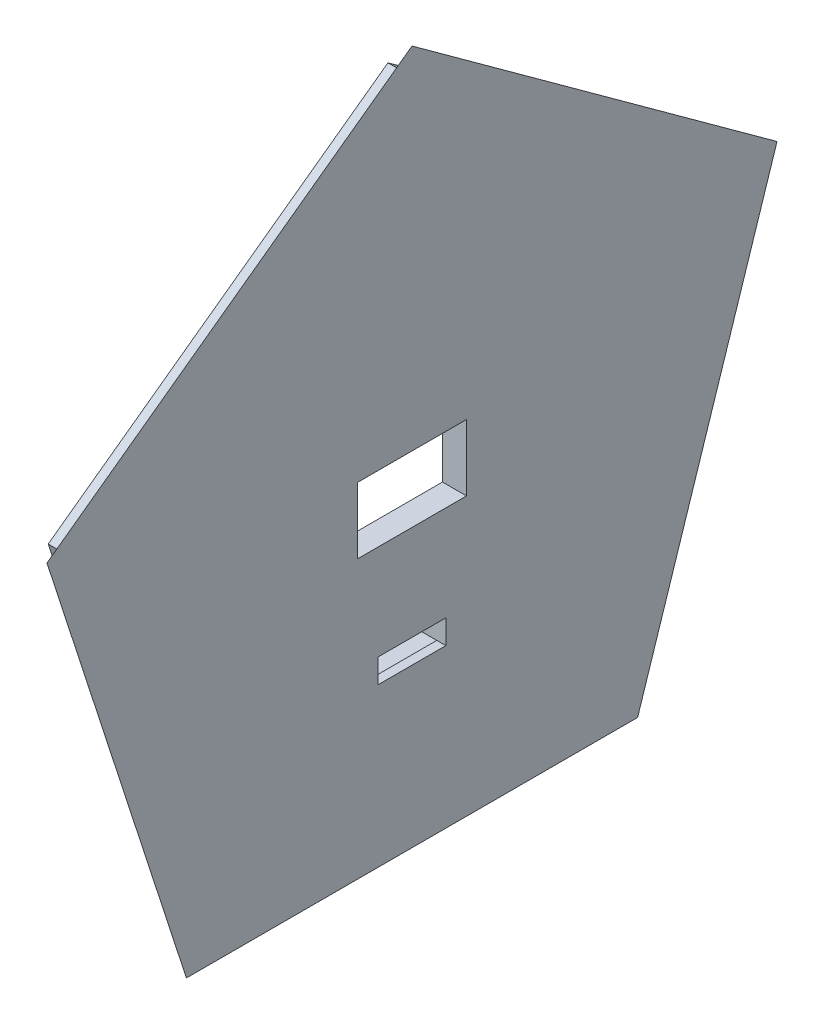
ISO-10303-21;
HEADER;
FILE_DESCRIPTION(('STEP AP214'),'2;1');
FILE_NAME('part.step','',(''),(''),'','','');
FILE_SCHEMA(('AUTOMOTIVE_DESIGN { 1 0 10303 214 1 1 1 1 }'));
ENDSEC;
DATA;
#1=APPLICATION_CONTEXT('core data for automotive mechanical design processes');
#2=APPLICATION_PROTOCOL_DEFINITION('international standard','automotive_design',2000,#1);
#3=PRODUCT_CONTEXT('',#1,'mechanical');
#4=PRODUCT('Part','Part','',(#3));
#5=PRODUCT_RELATED_PRODUCT_CATEGORY('part','',(#4));
#6=PRODUCT_DEFINITION_FORMATION('','',#4);
#7=PRODUCT_DEFINITION_CONTEXT('part definition',#1,'design');
#8=PRODUCT_DEFINITION('design','',#6,#7);
#9=PRODUCT_DEFINITION_SHAPE('','',#8);
#10=(LENGTH_UNIT() NAMED_UNIT(*) SI_UNIT(.MILLI.,.METRE.));
#11=(NAMED_UNIT(*) PLANE_ANGLE_UNIT() SI_UNIT($,.RADIAN.));
#12=(NAMED_UNIT(*) SI_UNIT($,.STERADIAN.) SOLID_ANGLE_UNIT());
#13=UNCERTAINTY_MEASURE_WITH_UNIT(LENGTH_MEASURE(1.E-05),#10,'distance_accuracy_value','');
#14=(GEOMETRIC_REPRESENTATION_CONTEXT(3) GLOBAL_UNCERTAINTY_ASSIGNED_CONTEXT((#13)) GLOBAL_UNIT_ASSIGNED_CONTEXT((#10,
#11,#12)) REPRESENTATION_CONTEXT('',''));
#15=CARTESIAN_POINT('',(0.,0.,0.));
#16=DIRECTION('',(0.,0.,1.));
#17=DIRECTION('',(1.,0.,0.));
#18=AXIS2_PLACEMENT_3D('',#15,#16,#17);
#19=CARTESIAN_POINT('',(100.418830026714,0.,0.));
#20=DIRECTION('',(1.,0.,0.));
#21=DIRECTION('',(0.,0.,-1.));
#22=AXIS2_PLACEMENT_3D('',#19,#20,#21);
#23=PLANE('',#22);
#24=DIRECTION('',(0.,-0.95105651629516,0.309016994374927));
#25=VECTOR('',#24,1.);
#26=CARTESIAN_POINT('',(100.418830026714,-65.9546860809559,91.8882149283744));
#27=LINE('',#26,#25);
#28=CARTESIAN_POINT('',(100.418830026714,-12.8437178954216,74.6314152788963));
#29=VERTEX_POINT('',#28);
#30=CARTESIAN_POINT('',(100.418830026714,-65.9546860809559,91.8882149283744));
#31=VERTEX_POINT('',#30);
#32=EDGE_CURVE('E313',#29,#31,#27,.T.);
#33=ORIENTED_EDGE('',*,*,#32,.T.);
#34=DIRECTION('',(0.,0.,1.));
#35=VECTOR('',#34,1.);
#36=CARTESIAN_POINT('',(100.418830026714,-65.9546860809571,147.732391668184));
#37=LINE('',#36,#35);
#38=CARTESIAN_POINT('',(100.418830026714,-65.9546860809571,147.732391668184));
#39=VERTEX_POINT('',#38);
#40=EDGE_CURVE('E369',#31,#39,#37,.T.);
#41=ORIENTED_EDGE('',*,*,#40,.T.);
#42=DIRECTION('',(0.,0.951056516295147,0.309016994374968));
#43=VECTOR('',#42,1.);
#44=CARTESIAN_POINT('',(100.418830026714,-12.8437178954237,164.989191317664));
#45=LINE('',#44,#43);
#46=CARTESIAN_POINT('',(100.418830026714,-12.8437178954237,164.989191317664));
#47=VERTEX_POINT('',#46);
#48=EDGE_CURVE('E372',#39,#47,#45,.T.);
#49=ORIENTED_EDGE('',*,*,#48,.T.);
#50=DIRECTION('',(0.,0.587785252292491,-0.809016994374934));
#51=VECTOR('',#50,1.);
#52=CARTESIAN_POINT('',(100.418830026714,19.9806656186516,119.810303298281));
#53=LINE('',#52,#51);
#54=CARTESIAN_POINT('',(100.418830026714,19.9806656186516,119.810303298281));
#55=VERTEX_POINT('',#54);
#56=EDGE_CURVE('E375',#47,#55,#53,.T.);
#57=ORIENTED_EDGE('',*,*,#56,.T.);
#58=DIRECTION('',(0.,-0.587785252292454,-0.809016994374961));
#59=VECTOR('',#58,1.);
#60=CARTESIAN_POINT('',(100.418830026714,-12.8437178954216,74.6314152788963));
#61=LINE('',#60,#59);
#62=EDGE_CURVE('E378',#55,#29,#61,.T.);
#63=ORIENTED_EDGE('',*,*,#62,.T.);
#64=EDGE_LOOP('',(#33,#41,#49,#57,#63));
#65=FACE_BOUND('',#64,.T.);
#66=DIRECTION('',(0.,0.,-1.));
#67=VECTOR('',#66,1.);
#68=CARTESIAN_POINT('',(100.418830026714,-31.9232284668228,127.060303298279));
#69=LINE('',#68,#67);
#70=CARTESIAN_POINT('',(100.418830026714,-31.9232284668228,127.060303298279));
#71=VERTEX_POINT('',#70);
#72=CARTESIAN_POINT('',(100.418830026714,-31.9232284668228,112.560303298279));
#73=VERTEX_POINT('',#72);
#74=EDGE_CURVE('E328',#71,#73,#69,.T.);
#75=ORIENTED_EDGE('',*,*,#74,.T.);
#76=DIRECTION('',(0.,1.,0.));
#77=VECTOR('',#76,1.);
#78=CARTESIAN_POINT('',(100.418830026714,-23.1232284668228,112.560303298279));
#79=LINE('',#78,#77);
#80=CARTESIAN_POINT('',(100.418830026714,-23.1232284668228,112.560303298279));
#81=VERTEX_POINT('',#80);
#82=EDGE_CURVE('E342',#73,#81,#79,.T.);
#83=ORIENTED_EDGE('',*,*,#82,.T.);
#84=DIRECTION('',(0.,0.,1.));
#85=VECTOR('',#84,1.);
#86=CARTESIAN_POINT('',(100.418830026714,-23.1232284668228,127.060303298279));
#87=LINE('',#86,#85);
#88=CARTESIAN_POINT('',(100.418830026714,-23.1232284668228,127.060303298279));
#89=VERTEX_POINT('',#88);
#90=EDGE_CURVE('E359',#81,#89,#87,.T.);
#91=ORIENTED_EDGE('',*,*,#90,.T.);
#92=DIRECTION('',(0.,-1.,0.));
#93=VECTOR('',#92,1.);
#94=CARTESIAN_POINT('',(100.418830026714,-23.1232284668228,127.060303298279));
#95=LINE('',#94,#93);
#96=EDGE_CURVE('E355',#89,#71,#95,.T.);
#97=ORIENTED_EDGE('',*,*,#96,.T.);
#98=EDGE_LOOP('',(#75,#83,#91,#97));
#99=FACE_BOUND('',#98,.T.);
#100=DIRECTION('',(0.,-1.,0.));
#101=VECTOR('',#100,1.);
#102=CARTESIAN_POINT('',(100.418830026714,-48.7877819389215,113.554337015382));
#103=LINE('',#102,#101);
#104=CARTESIAN_POINT('',(100.418830026714,-48.7877819389215,113.554337015382));
#105=VERTEX_POINT('',#104);
#106=CARTESIAN_POINT('',(100.418830026714,-50.3877819389215,113.554337015382));
#107=VERTEX_POINT('',#106);
#108=EDGE_CURVE('E228',#105,#107,#103,.T.);
#109=ORIENTED_EDGE('',*,*,#108,.F.);
#110=DIRECTION('',(0.,-1.,0.));
#111=VECTOR('',#110,1.);
#112=CARTESIAN_POINT('',(100.418830026714,-48.7877819389215,113.554337015382));
#113=LINE('',#112,#111);
#114=CARTESIAN_POINT('',(100.418830026714,-47.7877819389215,113.554337015382));
#115=VERTEX_POINT('',#114);
#116=EDGE_CURVE('E230',#115,#105,#113,.T.);
#117=ORIENTED_EDGE('',*,*,#116,.F.);
#118=DIRECTION('',(0.,0.,-1.));
#119=VECTOR('',#118,1.);
#120=CARTESIAN_POINT('',(100.418830026714,-47.7877819389215,126.066269581176));
#121=LINE('',#120,#119);
#122=CARTESIAN_POINT('',(100.418830026714,-47.7877819389215,115.310303298279));
#123=VERTEX_POINT('',#122);
#124=EDGE_CURVE('E264',#123,#115,#121,.T.);
#125=ORIENTED_EDGE('',*,*,#124,.F.);
#126=DIRECTION('',(0.,1.,0.));
#127=VECTOR('',#126,1.);
#128=CARTESIAN_POINT('',(100.418830026714,-44.5877819389215,115.310303298279));
#129=LINE('',#128,#127);
#130=CARTESIAN_POINT('',(100.418830026714,-44.5877819389215,115.310303298279));
#131=VERTEX_POINT('',#130);
#132=EDGE_CURVE('E281',#123,#131,#129,.T.);
#133=ORIENTED_EDGE('',*,*,#132,.T.);
#134=DIRECTION('',(0.,0.,1.));
#135=VECTOR('',#134,1.);
#136=CARTESIAN_POINT('',(100.418830026714,-44.5877819389215,124.310303298279));
#137=LINE('',#136,#135);
#138=CARTESIAN_POINT('',(100.418830026714,-44.5877819389215,124.310303298279));
#139=VERTEX_POINT('',#138);
#140=EDGE_CURVE('E285',#131,#139,#137,.T.);
#141=ORIENTED_EDGE('',*,*,#140,.T.);
#142=DIRECTION('',(0.,-1.,0.));
#143=VECTOR('',#142,1.);
#144=CARTESIAN_POINT('',(100.418830026714,-44.5877819389215,124.310303298279));
#145=LINE('',#144,#143);
#146=CARTESIAN_POINT('',(100.418830026714,-47.7877819389215,124.310303298279));
#147=VERTEX_POINT('',#146);
#148=EDGE_CURVE('E290',#139,#147,#145,.T.);
#149=ORIENTED_EDGE('',*,*,#148,.T.);
#150=CARTESIAN_POINT('',(100.418830026714,-47.7877819389215,126.066269581176));
#151=VERTEX_POINT('',#150);
#152=EDGE_CURVE('E246',#151,#147,#121,.T.);
#153=ORIENTED_EDGE('',*,*,#152,.F.);
#154=DIRECTION('',(0.,1.,0.));
#155=VECTOR('',#154,1.);
#156=CARTESIAN_POINT('',(100.418830026714,-48.7877819389215,126.066269581176));
#157=LINE('',#156,#155);
#158=CARTESIAN_POINT('',(100.418830026714,-48.7877819389215,126.066269581176));
#159=VERTEX_POINT('',#158);
#160=EDGE_CURVE('E235',#159,#151,#157,.T.);
#161=ORIENTED_EDGE('',*,*,#160,.F.);
#162=DIRECTION('',(0.,1.,0.));
#163=VECTOR('',#162,1.);
#164=CARTESIAN_POINT('',(100.418830026714,-48.7877819389215,126.066269581176));
#165=LINE('',#164,#163);
#166=CARTESIAN_POINT('',(100.418830026714,-50.3877819389215,126.066269581176));
#167=VERTEX_POINT('',#166);
#168=EDGE_CURVE('E225',#167,#159,#165,.T.);
#169=ORIENTED_EDGE('',*,*,#168,.F.);
#170=DIRECTION('',(0.,0.,1.));
#171=VECTOR('',#170,1.);
#172=CARTESIAN_POINT('',(100.418830026714,-50.3877819389215,113.554337015382));
#173=LINE('',#172,#171);
#174=EDGE_CURVE('E61',#107,#167,#173,.T.);
#175=ORIENTED_EDGE('',*,*,#174,.F.);
#176=EDGE_LOOP('',(#109,#117,#125,#133,#141,#149,#153,#161,#169,#175));
#177=FACE_BOUND('',#176,.T.);
#178=ADVANCED_FACE('F45',(#65,#99,#177),#23,.F.);
#179=CARTESIAN_POINT('',(100.418830026714,-47.7877819389215,124.310303298279));
#180=DIRECTION('',(0.,-1.,0.));
#181=DIRECTION('',(1.,0.,0.));
#182=AXIS2_PLACEMENT_3D('',#179,#180,#181);
#183=PLANE('',#182);
#184=DIRECTION('',(0.,0.,-1.));
#185=VECTOR('',#184,1.);
#186=CARTESIAN_POINT('',(102.418830026714,-47.7877819389215,126.066269581176));
#187=LINE('',#186,#185);
#188=CARTESIAN_POINT('',(102.418830026714,-47.7877819389215,124.310303298279));
#189=VERTEX_POINT('',#188);
#190=CARTESIAN_POINT('',(102.418830026714,-47.7877819389215,115.310303298279));
#191=VERTEX_POINT('',#190);
#192=EDGE_CURVE('E259',#189,#191,#187,.T.);
#193=ORIENTED_EDGE('',*,*,#192,.F.);
#194=DIRECTION('',(1.,0.,0.));
#195=VECTOR('',#194,1.);
#196=CARTESIAN_POINT('',(100.418830026714,-47.7877819389215,124.310303298279));
#197=LINE('',#196,#195);
#198=CARTESIAN_POINT('',(103.618830026714,-47.7877819389215,124.310303298279));
#199=VERTEX_POINT('',#198);
#200=EDGE_CURVE('E318',#189,#199,#197,.T.);
#201=ORIENTED_EDGE('',*,*,#200,.T.);
#202=DIRECTION('',(0.,0.,-1.));
#203=VECTOR('',#202,1.);
#204=CARTESIAN_POINT('',(103.618830026714,-47.7877819389215,124.310303298279));
#205=LINE('',#204,#203);
#206=CARTESIAN_POINT('',(103.618830026714,-47.7877819389215,115.310303298279));
#207=VERTEX_POINT('',#206);
#208=EDGE_CURVE('E286',#199,#207,#205,.T.);
#209=ORIENTED_EDGE('',*,*,#208,.T.);
#210=DIRECTION('',(1.,0.,0.));
#211=VECTOR('',#210,1.);
#212=CARTESIAN_POINT('',(100.418830026714,-47.7877819389215,115.310303298279));
#213=LINE('',#212,#211);
#214=EDGE_CURVE('E314',#191,#207,#213,.T.);
#215=ORIENTED_EDGE('',*,*,#214,.F.);
#216=EDGE_LOOP('',(#193,#201,#209,#215));
#217=FACE_BOUND('',#216,.T.);
#218=ADVANCED_FACE('F492',(#217),#183,.F.);
#219=CARTESIAN_POINT('',(103.618830026714,-68.8146860809572,149.810303298279));
#220=DIRECTION('',(-0.894427190999916,-0.138196601125019,0.425325404176017));
#221=DIRECTION('',(0.,-0.951056516295147,-0.309016994374969));
#222=AXIS2_PLACEMENT_3D('',#219,#220,#221);
#223=PLANE('',#222);
#224=DIRECTION('',(-0.374990901834979,-0.286467558057954,-0.881656487369827));
#225=VECTOR('',#224,1.);
#226=CARTESIAN_POINT('',(91.3590197777497,-21.1169567422077,139.526780319796));
#227=LINE('',#226,#225);
#228=CARTESIAN_POINT('',(103.618830026714,-11.7512951032485,168.351322960777));
#229=VERTEX_POINT('',#228);
#230=CARTESIAN_POINT('',(102.188830026714,-12.8437178954237,164.989191317664));
#231=VERTEX_POINT('',#230);
#232=EDGE_CURVE('E430',#229,#231,#227,.T.);
#233=ORIENTED_EDGE('',*,*,#232,.T.);
#234=DIRECTION('',(0.,-0.951056516295147,-0.309016994374967));
#235=VECTOR('',#234,1.);
#236=CARTESIAN_POINT('',(102.188830026714,-67.9308974770448,147.090281661675));
#237=LINE('',#236,#235);
#238=CARTESIAN_POINT('',(102.188830026714,-65.9546860809571,147.732391668184));
#239=VERTEX_POINT('',#238);
#240=EDGE_CURVE('E403',#231,#239,#237,.T.);
#241=ORIENTED_EDGE('',*,*,#240,.T.);
#242=DIRECTION('',(0.374990901834979,-0.74998180366997,0.544893675596375));
#243=VECTOR('',#242,1.);
#244=CARTESIAN_POINT('',(103.618830026714,-68.8146860809572,149.810303298279));
#245=LINE('',#244,#243);
#246=CARTESIAN_POINT('',(103.618830026714,-68.8146860809572,149.810303298279));
#247=VERTEX_POINT('',#246);
#248=EDGE_CURVE('E54',#239,#247,#245,.T.);
#249=ORIENTED_EDGE('',*,*,#248,.T.);
#250=DIRECTION('',(0.,0.951056516295147,0.309016994374969));
#251=VECTOR('',#250,1.);
#252=CARTESIAN_POINT('',(103.618830026714,-68.8146860809572,149.810303298279));
#253=LINE('',#252,#251);
#254=EDGE_CURVE('E424',#247,#229,#253,.T.);
#255=ORIENTED_EDGE('',*,*,#254,.T.);
#256=EDGE_LOOP('',(#233,#241,#249,#255));
#257=FACE_BOUND('',#256,.T.);
#258=ADVANCED_FACE('F477',(#257),#223,.T.);
#259=CARTESIAN_POINT('',(103.618830026714,-11.7512951032464,71.2692836357835));
#260=DIRECTION('',(-0.894427190999916,-0.138196601125001,-0.425325404176023));
#261=DIRECTION('',(0.,0.951056516295161,-0.309016994374926));
#262=AXIS2_PLACEMENT_3D('',#259,#260,#261);
#263=PLANE('',#262);
#264=DIRECTION('',(-0.374990901834979,0.749981803669946,0.544893675596408));
#265=VECTOR('',#264,1.);
#266=CARTESIAN_POINT('',(91.3590197777497,-44.2950655830282,107.624850360576));
#267=LINE('',#266,#265);
#268=CARTESIAN_POINT('',(103.618830026714,-68.814686080956,89.810303298279));
#269=VERTEX_POINT('',#268);
#270=CARTESIAN_POINT('',(102.188830026714,-65.9546860809559,91.8882149283744));
#271=VERTEX_POINT('',#270);
#272=EDGE_CURVE('E415',#269,#271,#267,.T.);
#273=ORIENTED_EDGE('',*,*,#272,.T.);
#274=DIRECTION('',(0.,0.95105651629516,-0.309016994374927));
#275=VECTOR('',#274,1.);
#276=CARTESIAN_POINT('',(102.188830026714,-10.8675064993341,73.9893052723876));
#277=LINE('',#276,#275);
#278=CARTESIAN_POINT('',(102.188830026714,-12.8437178954216,74.6314152788963));
#279=VERTEX_POINT('',#278);
#280=EDGE_CURVE('E399',#271,#279,#277,.T.);
#281=ORIENTED_EDGE('',*,*,#280,.T.);
#282=DIRECTION('',(0.374990901834979,0.286467558057993,-0.881656487369814));
#283=VECTOR('',#282,1.);
#284=CARTESIAN_POINT('',(103.618830026714,-11.7512951032463,71.2692836357835));
#285=LINE('',#284,#283);
#286=CARTESIAN_POINT('',(103.618830026714,-11.7512951032464,71.2692836357835));
#287=VERTEX_POINT('',#286);
#288=EDGE_CURVE('E416',#279,#287,#285,.T.);
#289=ORIENTED_EDGE('',*,*,#288,.T.);
#290=DIRECTION('',(0.,-0.95105651629516,0.309016994374926));
#291=VECTOR('',#290,1.);
#292=CARTESIAN_POINT('',(103.618830026714,-11.7512951032464,71.2692836357835));
#293=LINE('',#292,#291);
#294=EDGE_CURVE('E444',#287,#269,#293,.T.);
#295=ORIENTED_EDGE('',*,*,#294,.T.);
#296=EDGE_LOOP('',(#273,#281,#289,#295));
#297=FACE_BOUND('',#296,.T.);
#298=ADVANCED_FACE('F459',(#297),#263,.T.);
#299=CARTESIAN_POINT('',(103.618830026714,23.515820034301,119.810303298281));
#300=DIRECTION('',(-0.894427190999916,0.361803398874995,-0.262865556059559));
#301=DIRECTION('',(0.,0.587785252292455,0.809016994374961));
#302=AXIS2_PLACEMENT_3D('',#299,#300,#301);
#303=PLANE('',#302);
#304=ORIENTED_EDGE('',*,*,#288,.F.);
#305=DIRECTION('',(0.,0.587785252292455,0.80901699437496));
#306=VECTOR('',#305,1.);
#307=CARTESIAN_POINT('',(102.188830026714,21.2020314303887,121.491369119837));
#308=LINE('',#307,#306);
#309=CARTESIAN_POINT('',(102.188830026714,19.9806656186516,119.810303298281));
#310=VERTEX_POINT('',#309);
#311=EDGE_CURVE('E411',#279,#310,#308,.T.);
#312=ORIENTED_EDGE('',*,*,#311,.T.);
#313=DIRECTION('',(-0.374990901834979,-0.92702849122397,0.));
#314=VECTOR('',#313,1.);
#315=CARTESIAN_POINT('',(91.3590197777496,-6.79209768363547,119.81030329828));
#316=LINE('',#315,#314);
#317=CARTESIAN_POINT('',(103.618830026714,23.5158200343009,119.810303298281));
#318=VERTEX_POINT('',#317);
#319=EDGE_CURVE('E420',#318,#310,#316,.T.);
#320=ORIENTED_EDGE('',*,*,#319,.F.);
#321=DIRECTION('',(0.,-0.587785252292455,-0.809016994374961));
#322=VECTOR('',#321,1.);
#323=CARTESIAN_POINT('',(103.618830026714,23.5158200343009,119.810303298281));
#324=LINE('',#323,#322);
#325=EDGE_CURVE('E419',#318,#287,#324,.T.);
#326=ORIENTED_EDGE('',*,*,#325,.T.);
#327=EDGE_LOOP('',(#304,#312,#320,#326));
#328=FACE_BOUND('',#327,.T.);
#329=ADVANCED_FACE('F47',(#328),#303,.T.);
#330=CARTESIAN_POINT('',(103.618830026714,-11.7512951032486,168.351322960777));
#331=DIRECTION('',(-0.894427190999916,0.361803398874983,0.262865556059575));
#332=DIRECTION('',(0.,-0.587785252292491,0.809016994374934));
#333=AXIS2_PLACEMENT_3D('',#330,#331,#332);
#334=PLANE('',#333);
#335=ORIENTED_EDGE('',*,*,#319,.T.);
#336=DIRECTION('',(0.,-0.587785252292491,0.809016994374934));
#337=VECTOR('',#336,1.);
#338=CARTESIAN_POINT('',(102.188830026714,-14.0650837071609,166.670257139221));
#339=LINE('',#338,#337);
#340=EDGE_CURVE('E407',#310,#231,#339,.T.);
#341=ORIENTED_EDGE('',*,*,#340,.T.);
#342=ORIENTED_EDGE('',*,*,#232,.F.);
#343=DIRECTION('',(0.,0.587785252292491,-0.809016994374934));
#344=VECTOR('',#343,1.);
#345=CARTESIAN_POINT('',(103.618830026714,-11.7512951032486,168.351322960777));
#346=LINE('',#345,#344);
#347=EDGE_CURVE('E425',#229,#318,#346,.T.);
#348=ORIENTED_EDGE('',*,*,#347,.T.);
#349=EDGE_LOOP('',(#335,#341,#342,#348));
#350=FACE_BOUND('',#349,.T.);
#351=ADVANCED_FACE('F480',(#350),#334,.T.);
#352=CARTESIAN_POINT('',(103.618830026714,-68.814686080956,89.8103032982791));
#353=DIRECTION('',(-0.894427190999916,-0.447213595499958,0.));
#354=DIRECTION('',(0.,0.,-1.));
#355=AXIS2_PLACEMENT_3D('',#352,#353,#354);
#356=PLANE('',#355);
#357=ORIENTED_EDGE('',*,*,#248,.F.);
#358=DIRECTION('',(0.,0.,-1.));
#359=VECTOR('',#358,1.);
#360=CARTESIAN_POINT('',(102.188830026714,-65.9546860809559,89.8103032982791));
#361=LINE('',#360,#359);
#362=EDGE_CURVE('E11',#239,#271,#361,.T.);
#363=ORIENTED_EDGE('',*,*,#362,.T.);
#364=ORIENTED_EDGE('',*,*,#272,.F.);
#365=DIRECTION('',(0.,0.,1.));
#366=VECTOR('',#365,1.);
#367=CARTESIAN_POINT('',(103.618830026714,-68.814686080956,89.810303298279));
#368=LINE('',#367,#366);
#369=EDGE_CURVE('E429',#269,#247,#368,.T.);
#370=ORIENTED_EDGE('',*,*,#369,.T.);
#371=EDGE_LOOP('',(#357,#363,#364,#370));
#372=FACE_BOUND('',#371,.T.);
#373=ADVANCED_FACE('F468',(#372),#356,.T.);
#374=CARTESIAN_POINT('',(103.618830026714,-27.5232284668215,119.81030329828));
#375=DIRECTION('',(-1.,0.,0.));
#376=DIRECTION('',(0.,-0.951056516295139,-0.309016994374991));
#377=AXIS2_PLACEMENT_3D('',#374,#375,#376);
#378=PLANE('',#377);
#379=DIRECTION('',(0.,0.,1.));
#380=VECTOR('',#379,1.);
#381=CARTESIAN_POINT('',(103.618830026714,-44.5877819389215,124.310303298279));
#382=LINE('',#381,#380);
#383=CARTESIAN_POINT('',(103.618830026714,-44.5877819389215,115.310303298279));
#384=VERTEX_POINT('',#383);
#385=CARTESIAN_POINT('',(103.618830026714,-44.5877819389215,124.310303298279));
#386=VERTEX_POINT('',#385);
#387=EDGE_CURVE('E297',#384,#386,#382,.T.);
#388=ORIENTED_EDGE('',*,*,#387,.F.);
#389=DIRECTION('',(0.,1.,0.));
#390=VECTOR('',#389,1.);
#391=CARTESIAN_POINT('',(103.618830026714,-44.5877819389215,115.310303298279));
#392=LINE('',#391,#390);
#393=EDGE_CURVE('E69',#207,#384,#392,.T.);
#394=ORIENTED_EDGE('',*,*,#393,.F.);
#395=ORIENTED_EDGE('',*,*,#208,.F.);
#396=DIRECTION('',(0.,-1.,0.));
#397=VECTOR('',#396,1.);
#398=CARTESIAN_POINT('',(103.618830026714,-44.5877819389215,124.310303298279));
#399=LINE('',#398,#397);
#400=EDGE_CURVE('E302',#386,#199,#399,.T.);
#401=ORIENTED_EDGE('',*,*,#400,.F.);
#402=EDGE_LOOP('',(#388,#394,#395,#401));
#403=FACE_BOUND('',#402,.T.);
#404=DIRECTION('',(0.,0.,1.));
#405=VECTOR('',#404,1.);
#406=CARTESIAN_POINT('',(103.618830026714,-23.1232284668228,127.060303298279));
#407=LINE('',#406,#405);
#408=CARTESIAN_POINT('',(103.618830026714,-23.1232284668228,112.560303298279));
#409=VERTEX_POINT('',#408);
#410=CARTESIAN_POINT('',(103.618830026714,-23.1232284668228,127.060303298279));
#411=VERTEX_POINT('',#410);
#412=EDGE_CURVE('E346',#409,#411,#407,.T.);
#413=ORIENTED_EDGE('',*,*,#412,.F.);
#414=DIRECTION('',(0.,1.,0.));
#415=VECTOR('',#414,1.);
#416=CARTESIAN_POINT('',(103.618830026714,-23.1232284668228,112.560303298279));
#417=LINE('',#416,#415);
#418=CARTESIAN_POINT('',(103.618830026714,-31.9232284668228,112.560303298279));
#419=VERTEX_POINT('',#418);
#420=EDGE_CURVE('E298',#419,#409,#417,.T.);
#421=ORIENTED_EDGE('',*,*,#420,.F.);
#422=DIRECTION('',(0.,0.,-1.));
#423=VECTOR('',#422,1.);
#424=CARTESIAN_POINT('',(103.618830026714,-31.9232284668228,127.060303298279));
#425=LINE('',#424,#423);
#426=CARTESIAN_POINT('',(103.618830026714,-31.9232284668228,127.060303298279));
#427=VERTEX_POINT('',#426);
#428=EDGE_CURVE('E337',#427,#419,#425,.T.);
#429=ORIENTED_EDGE('',*,*,#428,.F.);
#430=DIRECTION('',(0.,-1.,0.));
#431=VECTOR('',#430,1.);
#432=CARTESIAN_POINT('',(103.618830026714,-23.1232284668228,127.060303298279));
#433=LINE('',#432,#431);
#434=EDGE_CURVE('E341',#411,#427,#433,.T.);
#435=ORIENTED_EDGE('',*,*,#434,.F.);
#436=EDGE_LOOP('',(#413,#421,#429,#435));
#437=FACE_BOUND('',#436,.T.);
#438=ORIENTED_EDGE('',*,*,#325,.F.);
#439=ORIENTED_EDGE('',*,*,#347,.F.);
#440=ORIENTED_EDGE('',*,*,#254,.F.);
#441=ORIENTED_EDGE('',*,*,#369,.F.);
#442=ORIENTED_EDGE('',*,*,#294,.F.);
#443=EDGE_LOOP('',(#438,#439,#440,#441,#442));
#444=FACE_BOUND('',#443,.T.);
#445=ADVANCED_FACE('F454',(#403,#437,#444),#378,.F.);
#446=CARTESIAN_POINT('',(100.418830026714,-65.9546860809559,91.8882149283744));
#447=DIRECTION('',(0.,0.309016994374927,0.95105651629516));
#448=DIRECTION('',(0.,-0.95105651629516,0.309016994374927));
#449=AXIS2_PLACEMENT_3D('',#446,#447,#448);
#450=PLANE('',#449);
#451=ORIENTED_EDGE('',*,*,#280,.F.);
#452=DIRECTION('',(1.,0.,0.));
#453=VECTOR('',#452,1.);
#454=CARTESIAN_POINT('',(100.418830026714,-65.9546860809559,91.8882149283744));
#455=LINE('',#454,#453);
#456=EDGE_CURVE('E396',#31,#271,#455,.T.);
#457=ORIENTED_EDGE('',*,*,#456,.F.);
#458=ORIENTED_EDGE('',*,*,#32,.F.);
#459=DIRECTION('',(1.,0.,0.));
#460=VECTOR('',#459,1.);
#461=CARTESIAN_POINT('',(100.418830026714,-12.8437178954216,74.6314152788963));
#462=LINE('',#461,#460);
#463=EDGE_CURVE('E381',#29,#279,#462,.T.);
#464=ORIENTED_EDGE('',*,*,#463,.T.);
#465=EDGE_LOOP('',(#451,#457,#458,#464));
#466=FACE_BOUND('',#465,.T.);
#467=ADVANCED_FACE('F463',(#466),#450,.F.);
#468=CARTESIAN_POINT('',(100.418830026714,-65.9546860809571,147.732391668184));
#469=DIRECTION('',(0.,1.,0.));
#470=DIRECTION('',(0.,0.,1.));
#471=AXIS2_PLACEMENT_3D('',#468,#469,#470);
#472=PLANE('',#471);
#473=ORIENTED_EDGE('',*,*,#362,.F.);
#474=DIRECTION('',(1.,0.,0.));
#475=VECTOR('',#474,1.);
#476=CARTESIAN_POINT('',(100.418830026714,-65.9546860809571,147.732391668184));
#477=LINE('',#476,#475);
#478=EDGE_CURVE('E392',#39,#239,#477,.T.);
#479=ORIENTED_EDGE('',*,*,#478,.F.);
#480=ORIENTED_EDGE('',*,*,#40,.F.);
#481=ORIENTED_EDGE('',*,*,#456,.T.);
#482=EDGE_LOOP('',(#473,#479,#480,#481));
#483=FACE_BOUND('',#482,.T.);
#484=ADVANCED_FACE('F471',(#483),#472,.F.);
#485=CARTESIAN_POINT('',(100.418830026714,-12.8437178954237,164.989191317664));
#486=DIRECTION('',(0.,0.309016994374968,-0.951056516295147));
#487=DIRECTION('',(0.,0.951056516295147,0.309016994374968));
#488=AXIS2_PLACEMENT_3D('',#485,#486,#487);
#489=PLANE('',#488);
#490=ORIENTED_EDGE('',*,*,#240,.F.);
#491=DIRECTION('',(1.,0.,0.));
#492=VECTOR('',#491,1.);
#493=CARTESIAN_POINT('',(100.418830026714,-12.8437178954237,164.989191317664));
#494=LINE('',#493,#492);
#495=EDGE_CURVE('E388',#47,#231,#494,.T.);
#496=ORIENTED_EDGE('',*,*,#495,.F.);
#497=ORIENTED_EDGE('',*,*,#48,.F.);
#498=ORIENTED_EDGE('',*,*,#478,.T.);
#499=EDGE_LOOP('',(#490,#496,#497,#498));
#500=FACE_BOUND('',#499,.T.);
#501=ADVANCED_FACE('F474',(#500),#489,.F.);
#502=CARTESIAN_POINT('',(100.418830026714,19.9806656186516,119.810303298281));
#503=DIRECTION('',(0.,-0.809016994374934,-0.587785252292491));
#504=DIRECTION('',(0.,0.587785252292491,-0.809016994374934));
#505=AXIS2_PLACEMENT_3D('',#502,#503,#504);
#506=PLANE('',#505);
#507=ORIENTED_EDGE('',*,*,#340,.F.);
#508=DIRECTION('',(1.,0.,0.));
#509=VECTOR('',#508,1.);
#510=CARTESIAN_POINT('',(100.418830026714,19.9806656186516,119.810303298281));
#511=LINE('',#510,#509);
#512=EDGE_CURVE('E385',#55,#310,#511,.T.);
#513=ORIENTED_EDGE('',*,*,#512,.F.);
#514=ORIENTED_EDGE('',*,*,#56,.F.);
#515=ORIENTED_EDGE('',*,*,#495,.T.);
#516=EDGE_LOOP('',(#507,#513,#514,#515));
#517=FACE_BOUND('',#516,.T.);
#518=ADVANCED_FACE('F484',(#517),#506,.F.);
#519=CARTESIAN_POINT('',(100.418830026714,-12.8437178954216,74.6314152788963));
#520=DIRECTION('',(0.,-0.809016994374961,0.587785252292454));
#521=DIRECTION('',(0.,-0.587785252292454,-0.809016994374961));
#522=AXIS2_PLACEMENT_3D('',#519,#520,#521);
#523=PLANE('',#522);
#524=ORIENTED_EDGE('',*,*,#311,.F.);
#525=ORIENTED_EDGE('',*,*,#463,.F.);
#526=ORIENTED_EDGE('',*,*,#62,.F.);
#527=ORIENTED_EDGE('',*,*,#512,.T.);
#528=EDGE_LOOP('',(#524,#525,#526,#527));
#529=FACE_BOUND('',#528,.T.);
#530=ADVANCED_FACE('F488',(#529),#523,.F.);
#531=CARTESIAN_POINT('',(100.418830026714,-23.1232284668228,112.560303298279));
#532=DIRECTION('',(0.,0.,-1.));
#533=DIRECTION('',(-1.,0.,0.));
#534=AXIS2_PLACEMENT_3D('',#531,#532,#533);
#535=PLANE('',#534);
#536=ORIENTED_EDGE('',*,*,#420,.T.);
#537=DIRECTION('',(1.,0.,0.));
#538=VECTOR('',#537,1.);
#539=CARTESIAN_POINT('',(100.418830026714,-23.1232284668228,112.560303298279));
#540=LINE('',#539,#538);
#541=EDGE_CURVE('E324',#81,#409,#540,.T.);
#542=ORIENTED_EDGE('',*,*,#541,.F.);
#543=ORIENTED_EDGE('',*,*,#82,.F.);
#544=DIRECTION('',(1.,0.,0.));
#545=VECTOR('',#544,1.);
#546=CARTESIAN_POINT('',(100.418830026714,-31.9232284668228,112.560303298279));
#547=LINE('',#546,#545);
#548=EDGE_CURVE('E271',#73,#419,#547,.T.);
#549=ORIENTED_EDGE('',*,*,#548,.T.);
#550=EDGE_LOOP('',(#536,#542,#543,#549));
#551=FACE_BOUND('',#550,.T.);
#552=ADVANCED_FACE('F582',(#551),#535,.F.);
#553=CARTESIAN_POINT('',(100.418830026714,-31.9232284668228,127.060303298279));
#554=DIRECTION('',(0.,-1.,0.));
#555=DIRECTION('',(1.,0.,0.));
#556=AXIS2_PLACEMENT_3D('',#553,#554,#555);
#557=PLANE('',#556);
#558=ORIENTED_EDGE('',*,*,#428,.T.);
#559=ORIENTED_EDGE('',*,*,#548,.F.);
#560=ORIENTED_EDGE('',*,*,#74,.F.);
#561=DIRECTION('',(1.,0.,0.));
#562=VECTOR('',#561,1.);
#563=CARTESIAN_POINT('',(100.418830026714,-31.9232284668228,127.060303298279));
#564=LINE('',#563,#562);
#565=EDGE_CURVE('E332',#71,#427,#564,.T.);
#566=ORIENTED_EDGE('',*,*,#565,.T.);
#567=EDGE_LOOP('',(#558,#559,#560,#566));
#568=FACE_BOUND('',#567,.T.);
#569=ADVANCED_FACE('F585',(#568),#557,.F.);
#570=CARTESIAN_POINT('',(100.418830026714,-23.1232284668228,127.060303298279));
#571=DIRECTION('',(0.,0.,1.));
#572=DIRECTION('',(1.,0.,0.));
#573=AXIS2_PLACEMENT_3D('',#570,#571,#572);
#574=PLANE('',#573);
#575=ORIENTED_EDGE('',*,*,#434,.T.);
#576=ORIENTED_EDGE('',*,*,#565,.F.);
#577=ORIENTED_EDGE('',*,*,#96,.F.);
#578=DIRECTION('',(1.,0.,0.));
#579=VECTOR('',#578,1.);
#580=CARTESIAN_POINT('',(100.418830026714,-23.1232284668228,127.060303298279));
#581=LINE('',#580,#579);
#582=EDGE_CURVE('E329',#89,#411,#581,.T.);
#583=ORIENTED_EDGE('',*,*,#582,.T.);
#584=EDGE_LOOP('',(#575,#576,#577,#583));
#585=FACE_BOUND('',#584,.T.);
#586=ADVANCED_FACE('F589',(#585),#574,.F.);
#587=CARTESIAN_POINT('',(100.418830026714,-23.1232284668228,127.060303298279));
#588=DIRECTION('',(0.,1.,0.));
#589=DIRECTION('',(-1.,0.,0.));
#590=AXIS2_PLACEMENT_3D('',#587,#588,#589);
#591=PLANE('',#590);
#592=ORIENTED_EDGE('',*,*,#412,.T.);
#593=ORIENTED_EDGE('',*,*,#582,.F.);
#594=ORIENTED_EDGE('',*,*,#90,.F.);
#595=ORIENTED_EDGE('',*,*,#541,.T.);
#596=EDGE_LOOP('',(#592,#593,#594,#595));
#597=FACE_BOUND('',#596,.T.);
#598=ADVANCED_FACE('F581',(#597),#591,.F.);
#599=CARTESIAN_POINT('',(100.418830026714,-44.5877819389215,115.310303298279));
#600=DIRECTION('',(0.,0.,-1.));
#601=DIRECTION('',(-1.,0.,0.));
#602=AXIS2_PLACEMENT_3D('',#599,#600,#601);
#603=PLANE('',#602);
#604=ORIENTED_EDGE('',*,*,#393,.T.);
#605=DIRECTION('',(1.,0.,0.));
#606=VECTOR('',#605,1.);
#607=CARTESIAN_POINT('',(100.418830026714,-44.5877819389215,115.310303298279));
#608=LINE('',#607,#606);
#609=EDGE_CURVE('E294',#131,#384,#608,.T.);
#610=ORIENTED_EDGE('',*,*,#609,.F.);
#611=ORIENTED_EDGE('',*,*,#132,.F.);
#612=EDGE_CURVE('E309',#123,#191,#213,.T.);
#613=ORIENTED_EDGE('',*,*,#612,.T.);
#614=ORIENTED_EDGE('',*,*,#214,.T.);
#615=EDGE_LOOP('',(#604,#610,#611,#613,#614));
#616=FACE_BOUND('',#615,.T.);
#617=ADVANCED_FACE('F541',(#616),#603,.F.);
#618=CARTESIAN_POINT('',(100.418830026714,-44.5877819389215,124.310303298279));
#619=DIRECTION('',(0.,0.,1.));
#620=DIRECTION('',(0.,-1.,0.));
#621=AXIS2_PLACEMENT_3D('',#618,#619,#620);
#622=PLANE('',#621);
#623=ORIENTED_EDGE('',*,*,#400,.T.);
#624=ORIENTED_EDGE('',*,*,#200,.F.);
#625=EDGE_CURVE('E315',#147,#189,#197,.T.);
#626=ORIENTED_EDGE('',*,*,#625,.F.);
#627=ORIENTED_EDGE('',*,*,#148,.F.);
#628=DIRECTION('',(1.,0.,0.));
#629=VECTOR('',#628,1.);
#630=CARTESIAN_POINT('',(100.418830026714,-44.5877819389215,124.310303298279));
#631=LINE('',#630,#629);
#632=EDGE_CURVE('E319',#139,#386,#631,.T.);
#633=ORIENTED_EDGE('',*,*,#632,.T.);
#634=EDGE_LOOP('',(#623,#624,#626,#627,#633));
#635=FACE_BOUND('',#634,.T.);
#636=ADVANCED_FACE('F556',(#635),#622,.F.);
#637=CARTESIAN_POINT('',(100.418830026714,-44.5877819389215,124.310303298279));
#638=DIRECTION('',(0.,1.,0.));
#639=DIRECTION('',(-1.,0.,0.));
#640=AXIS2_PLACEMENT_3D('',#637,#638,#639);
#641=PLANE('',#640);
#642=ORIENTED_EDGE('',*,*,#387,.T.);
#643=ORIENTED_EDGE('',*,*,#632,.F.);
#644=ORIENTED_EDGE('',*,*,#140,.F.);
#645=ORIENTED_EDGE('',*,*,#609,.T.);
#646=EDGE_LOOP('',(#642,#643,#644,#645));
#647=FACE_BOUND('',#646,.T.);
#648=ADVANCED_FACE('F551',(#647),#641,.F.);
#649=CARTESIAN_POINT('',(102.418830026714,-47.7877819389215,126.066269581176));
#650=DIRECTION('',(0.,1.,0.));
#651=DIRECTION('',(0.,0.,1.));
#652=AXIS2_PLACEMENT_3D('',#649,#650,#651);
#653=PLANE('',#652);
#654=ORIENTED_EDGE('',*,*,#124,.T.);
#655=DIRECTION('',(-1.,0.,0.));
#656=VECTOR('',#655,1.);
#657=CARTESIAN_POINT('',(102.418830026714,-47.7877819389215,113.554337015382));
#658=LINE('',#657,#656);
#659=CARTESIAN_POINT('',(102.418830026714,-47.7877819389215,113.554337015382));
#660=VERTEX_POINT('',#659);
#661=EDGE_CURVE('E267',#660,#115,#658,.T.);
#662=ORIENTED_EDGE('',*,*,#661,.F.);
#663=EDGE_CURVE('E254',#191,#660,#187,.T.);
#664=ORIENTED_EDGE('',*,*,#663,.F.);
#665=ORIENTED_EDGE('',*,*,#612,.F.);
#666=EDGE_LOOP('',(#654,#662,#664,#665));
#667=FACE_BOUND('',#666,.T.);
#668=ADVANCED_FACE('F535',(#667),#653,.F.);
#669=CARTESIAN_POINT('',(102.418830026714,-47.7877819389215,126.066269581176));
#670=VERTEX_POINT('',#669);
#671=EDGE_CURVE('E255',#670,#189,#187,.T.);
#672=ORIENTED_EDGE('',*,*,#671,.F.);
#673=DIRECTION('',(-1.,0.,0.));
#674=VECTOR('',#673,1.);
#675=CARTESIAN_POINT('',(102.418830026714,-47.7877819389215,126.066269581176));
#676=LINE('',#675,#674);
#677=EDGE_CURVE('E272',#670,#151,#676,.T.);
#678=ORIENTED_EDGE('',*,*,#677,.T.);
#679=ORIENTED_EDGE('',*,*,#152,.T.);
#680=ORIENTED_EDGE('',*,*,#625,.T.);
#681=EDGE_LOOP('',(#672,#678,#679,#680));
#682=FACE_BOUND('',#681,.T.);
#683=ADVANCED_FACE('F558',(#682),#653,.F.);
#684=CARTESIAN_POINT('',(102.418830026714,-48.7877819389215,113.554337015382));
#685=DIRECTION('',(0.,0.,-1.));
#686=DIRECTION('',(-1.,0.,0.));
#687=AXIS2_PLACEMENT_3D('',#684,#685,#686);
#688=PLANE('',#687);
#689=ORIENTED_EDGE('',*,*,#116,.T.);
#690=DIRECTION('',(-1.,0.,0.));
#691=VECTOR('',#690,1.);
#692=CARTESIAN_POINT('',(102.418830026714,-48.7877819389215,113.554337015382));
#693=LINE('',#692,#691);
#694=CARTESIAN_POINT('',(102.418830026714,-48.7877819389215,113.554337015382));
#695=VERTEX_POINT('',#694);
#696=EDGE_CURVE('E258',#695,#105,#693,.T.);
#697=ORIENTED_EDGE('',*,*,#696,.F.);
#698=DIRECTION('',(0.,-1.,0.));
#699=VECTOR('',#698,1.);
#700=CARTESIAN_POINT('',(102.418830026714,-48.7877819389215,113.554337015382));
#701=LINE('',#700,#699);
#702=EDGE_CURVE('E241',#660,#695,#701,.T.);
#703=ORIENTED_EDGE('',*,*,#702,.F.);
#704=ORIENTED_EDGE('',*,*,#661,.T.);
#705=EDGE_LOOP('',(#689,#697,#703,#704));
#706=FACE_BOUND('',#705,.T.);
#707=ADVANCED_FACE('F505',(#706),#688,.F.);
#708=CARTESIAN_POINT('',(102.418830026714,-48.7877819389215,126.066269581176));
#709=DIRECTION('',(0.,0.,1.));
#710=DIRECTION('',(1.,0.,0.));
#711=AXIS2_PLACEMENT_3D('',#708,#709,#710);
#712=PLANE('',#711);
#713=ORIENTED_EDGE('',*,*,#160,.T.);
#714=ORIENTED_EDGE('',*,*,#677,.F.);
#715=DIRECTION('',(0.,1.,0.));
#716=VECTOR('',#715,1.);
#717=CARTESIAN_POINT('',(102.418830026714,-48.7877819389215,126.066269581176));
#718=LINE('',#717,#716);
#719=CARTESIAN_POINT('',(102.418830026714,-48.7877819389215,126.066269581176));
#720=VERTEX_POINT('',#719);
#721=EDGE_CURVE('E250',#720,#670,#718,.T.);
#722=ORIENTED_EDGE('',*,*,#721,.F.);
#723=DIRECTION('',(-1.,0.,0.));
#724=VECTOR('',#723,1.);
#725=CARTESIAN_POINT('',(102.418830026714,-48.7877819389215,126.066269581176));
#726=LINE('',#725,#724);
#727=EDGE_CURVE('E275',#720,#159,#726,.T.);
#728=ORIENTED_EDGE('',*,*,#727,.T.);
#729=EDGE_LOOP('',(#713,#714,#722,#728));
#730=FACE_BOUND('',#729,.T.);
#731=ADVANCED_FACE('F526',(#730),#712,.F.);
#732=CARTESIAN_POINT('',(102.418830026714,-48.7877819389215,126.066269581176));
#733=DIRECTION('',(0.,-1.,0.));
#734=DIRECTION('',(0.,0.,-1.));
#735=AXIS2_PLACEMENT_3D('',#732,#733,#734);
#736=PLANE('',#735);
#737=ORIENTED_EDGE('',*,*,#696,.T.);
#738=DIRECTION('',(1.,0.,0.));
#739=VECTOR('',#738,1.);
#740=CARTESIAN_POINT('',(97.4188300267137,-48.7877819389215,113.554337015382));
#741=LINE('',#740,#739);
#742=CARTESIAN_POINT('',(97.4188300267137,-48.7877819389215,113.554337015382));
#743=VERTEX_POINT('',#742);
#744=EDGE_CURVE('E502',#743,#105,#741,.T.);
#745=ORIENTED_EDGE('',*,*,#744,.F.);
#746=DIRECTION('',(0.,0.,-1.));
#747=VECTOR('',#746,1.);
#748=CARTESIAN_POINT('',(97.4188300267137,-48.7877819389215,113.554337015382));
#749=LINE('',#748,#747);
#750=CARTESIAN_POINT('',(97.4188300267137,-48.7877819389215,126.066269581176));
#751=VERTEX_POINT('',#750);
#752=EDGE_CURVE('E220',#751,#743,#749,.T.);
#753=ORIENTED_EDGE('',*,*,#752,.F.);
#754=DIRECTION('',(1.,0.,0.));
#755=VECTOR('',#754,1.);
#756=CARTESIAN_POINT('',(97.4188300267137,-48.7877819389215,126.066269581176));
#757=LINE('',#756,#755);
#758=EDGE_CURVE('E237',#751,#159,#757,.T.);
#759=ORIENTED_EDGE('',*,*,#758,.T.);
#760=ORIENTED_EDGE('',*,*,#727,.F.);
#761=DIRECTION('',(0.,0.,1.));
#762=VECTOR('',#761,1.);
#763=CARTESIAN_POINT('',(102.418830026714,-48.7877819389215,126.066269581176));
#764=LINE('',#763,#762);
#765=EDGE_CURVE('E245',#695,#720,#764,.T.);
#766=ORIENTED_EDGE('',*,*,#765,.F.);
#767=EDGE_LOOP('',(#737,#745,#753,#759,#760,#766));
#768=FACE_BOUND('',#767,.T.);
#769=ADVANCED_FACE('F501',(#768),#736,.F.);
#770=CARTESIAN_POINT('',(102.418830026714,0.,0.));
#771=DIRECTION('',(-1.,0.,0.));
#772=DIRECTION('',(0.,0.,1.));
#773=AXIS2_PLACEMENT_3D('',#770,#771,#772);
#774=PLANE('',#773);
#775=ORIENTED_EDGE('',*,*,#702,.T.);
#776=ORIENTED_EDGE('',*,*,#765,.T.);
#777=ORIENTED_EDGE('',*,*,#721,.T.);
#778=ORIENTED_EDGE('',*,*,#671,.T.);
#779=ORIENTED_EDGE('',*,*,#192,.T.);
#780=ORIENTED_EDGE('',*,*,#663,.T.);
#781=EDGE_LOOP('',(#775,#776,#777,#778,#779,#780));
#782=FACE_BOUND('',#781,.T.);
#783=ADVANCED_FACE('F529',(#782),#774,.T.);
#784=CARTESIAN_POINT('',(97.4188300267137,-48.7877819389215,113.554337015382));
#785=DIRECTION('',(0.,0.,1.));
#786=DIRECTION('',(1.,0.,0.));
#787=AXIS2_PLACEMENT_3D('',#784,#785,#786);
#788=PLANE('',#787);
#789=ORIENTED_EDGE('',*,*,#108,.T.);
#790=DIRECTION('',(1.,0.,0.));
#791=VECTOR('',#790,1.);
#792=CARTESIAN_POINT('',(97.4188300267137,-50.3877819389215,113.554337015382));
#793=LINE('',#792,#791);
#794=CARTESIAN_POINT('',(97.4188300267137,-50.3877819389215,113.554337015382));
#795=VERTEX_POINT('',#794);
#796=EDGE_CURVE('E207',#795,#107,#793,.T.);
#797=ORIENTED_EDGE('',*,*,#796,.F.);
#798=DIRECTION('',(0.,-1.,0.));
#799=VECTOR('',#798,1.);
#800=CARTESIAN_POINT('',(97.4188300267137,-48.7877819389215,113.554337015382));
#801=LINE('',#800,#799);
#802=EDGE_CURVE('E215',#743,#795,#801,.T.);
#803=ORIENTED_EDGE('',*,*,#802,.F.);
#804=ORIENTED_EDGE('',*,*,#744,.T.);
#805=EDGE_LOOP('',(#789,#797,#803,#804));
#806=FACE_BOUND('',#805,.T.);
#807=ADVANCED_FACE('F227',(#806),#788,.F.);
#808=CARTESIAN_POINT('',(97.4188300267137,-50.3877819389215,113.554337015382));
#809=DIRECTION('',(0.,1.,0.));
#810=DIRECTION('',(0.,0.,1.));
#811=AXIS2_PLACEMENT_3D('',#808,#809,#810);
#812=PLANE('',#811);
#813=ORIENTED_EDGE('',*,*,#174,.T.);
#814=DIRECTION('',(1.,0.,0.));
#815=VECTOR('',#814,1.);
#816=CARTESIAN_POINT('',(97.4188300267137,-50.3877819389215,126.066269581176));
#817=LINE('',#816,#815);
#818=CARTESIAN_POINT('',(97.4188300267137,-50.3877819389215,126.066269581176));
#819=VERTEX_POINT('',#818);
#820=EDGE_CURVE('E210',#819,#167,#817,.T.);
#821=ORIENTED_EDGE('',*,*,#820,.F.);
#822=DIRECTION('',(0.,0.,1.));
#823=VECTOR('',#822,1.);
#824=CARTESIAN_POINT('',(97.4188300267137,-50.3877819389215,113.554337015382));
#825=LINE('',#824,#823);
#826=EDGE_CURVE('E203',#795,#819,#825,.T.);
#827=ORIENTED_EDGE('',*,*,#826,.F.);
#828=ORIENTED_EDGE('',*,*,#796,.T.);
#829=EDGE_LOOP('',(#813,#821,#827,#828));
#830=FACE_BOUND('',#829,.T.);
#831=ADVANCED_FACE('F205',(#830),#812,.F.);
#832=CARTESIAN_POINT('',(97.4188300267137,-48.7877819389215,126.066269581176));
#833=DIRECTION('',(0.,0.,-1.));
#834=DIRECTION('',(-1.,0.,0.));
#835=AXIS2_PLACEMENT_3D('',#832,#833,#834);
#836=PLANE('',#835);
#837=ORIENTED_EDGE('',*,*,#168,.T.);
#838=ORIENTED_EDGE('',*,*,#758,.F.);
#839=DIRECTION('',(0.,1.,0.));
#840=VECTOR('',#839,1.);
#841=CARTESIAN_POINT('',(97.4188300267137,-48.7877819389215,126.066269581176));
#842=LINE('',#841,#840);
#843=EDGE_CURVE('E214',#819,#751,#842,.T.);
#844=ORIENTED_EDGE('',*,*,#843,.F.);
#845=ORIENTED_EDGE('',*,*,#820,.T.);
#846=EDGE_LOOP('',(#837,#838,#844,#845));
#847=FACE_BOUND('',#846,.T.);
#848=ADVANCED_FACE('F522',(#847),#836,.F.);
#849=CARTESIAN_POINT('',(97.4188300267137,0.,0.));
#850=DIRECTION('',(-1.,0.,0.));
#851=DIRECTION('',(0.,0.,1.));
#852=AXIS2_PLACEMENT_3D('',#849,#850,#851);
#853=PLANE('',#852);
#854=ORIENTED_EDGE('',*,*,#802,.T.);
#855=ORIENTED_EDGE('',*,*,#826,.T.);
#856=ORIENTED_EDGE('',*,*,#843,.T.);
#857=ORIENTED_EDGE('',*,*,#752,.T.);
#858=EDGE_LOOP('',(#854,#855,#856,#857));
#859=FACE_BOUND('',#858,.T.);
#860=ADVANCED_FACE('F218',(#859),#853,.T.);
#861=CLOSED_SHELL('',(#178,#218,#258,#298,#329,#351,#373,#445,#467,#484,#501,#518,#530,#552,
#569,#586,#598,#617,#636,#648,#668,#683,#707,#731,#769,#783,#807,#831,#848,#860));
#862=MANIFOLD_SOLID_BREP('B2',#861);
#863=ADVANCED_BREP_SHAPE_REPRESENTATION('',(#18,#862),#14);
#864=SHAPE_DEFINITION_REPRESENTATION(#9,#863);
ENDSEC;
END-ISO-10303-21;
